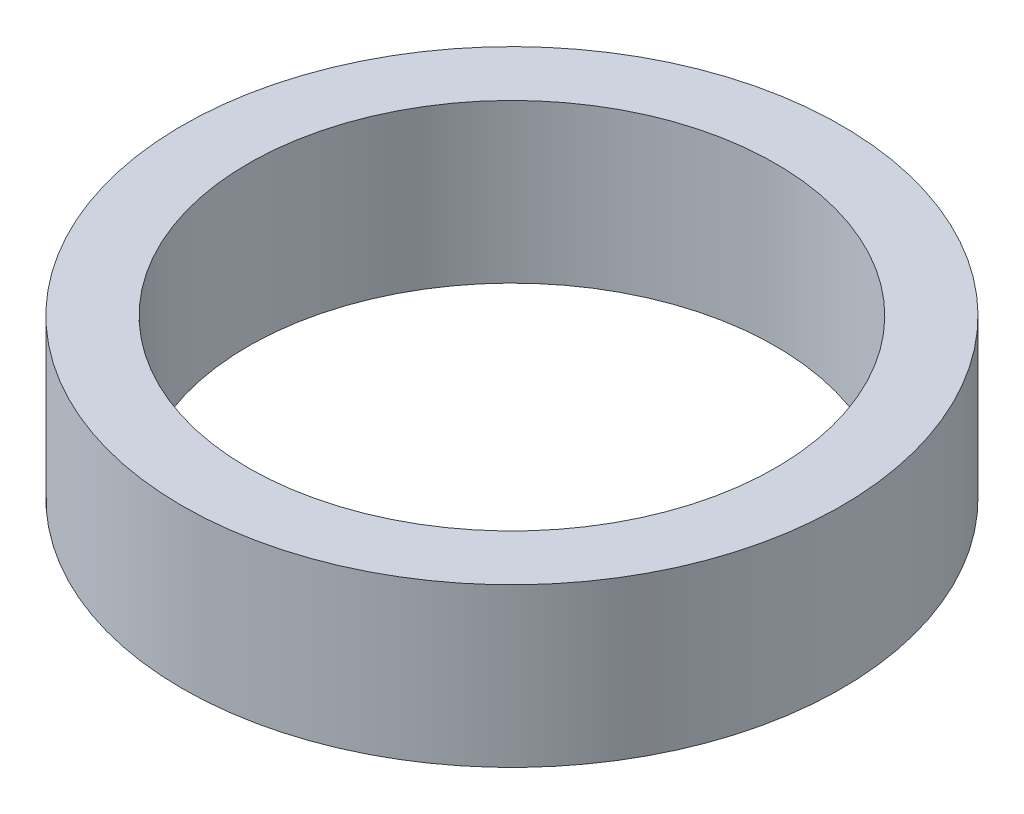
ISO-10303-21;
HEADER;
FILE_DESCRIPTION(('STEP AP214'),'2;1');
FILE_NAME('part.step','',(''),(''),'','','');
FILE_SCHEMA(('AUTOMOTIVE_DESIGN { 1 0 10303 214 1 1 1 1 }'));
ENDSEC;
DATA;
#1=APPLICATION_CONTEXT('core data for automotive mechanical design processes');
#2=APPLICATION_PROTOCOL_DEFINITION('international standard','automotive_design',2000,#1);
#3=PRODUCT_CONTEXT('',#1,'mechanical');
#4=PRODUCT('Part','Part','',(#3));
#5=PRODUCT_RELATED_PRODUCT_CATEGORY('part','',(#4));
#6=PRODUCT_DEFINITION_FORMATION('','',#4);
#7=PRODUCT_DEFINITION_CONTEXT('part definition',#1,'design');
#8=PRODUCT_DEFINITION('design','',#6,#7);
#9=PRODUCT_DEFINITION_SHAPE('','',#8);
#10=(LENGTH_UNIT() NAMED_UNIT(*) SI_UNIT(.MILLI.,.METRE.));
#11=(NAMED_UNIT(*) PLANE_ANGLE_UNIT() SI_UNIT($,.RADIAN.));
#12=(NAMED_UNIT(*) SI_UNIT($,.STERADIAN.) SOLID_ANGLE_UNIT());
#13=UNCERTAINTY_MEASURE_WITH_UNIT(LENGTH_MEASURE(1.E-05),#10,'distance_accuracy_value','');
#14=(GEOMETRIC_REPRESENTATION_CONTEXT(3) GLOBAL_UNCERTAINTY_ASSIGNED_CONTEXT((#13)) GLOBAL_UNIT_ASSIGNED_CONTEXT((#10,
#11,#12)) REPRESENTATION_CONTEXT('',''));
#15=CARTESIAN_POINT('',(0.,0.,0.));
#16=DIRECTION('',(0.,0.,1.));
#17=DIRECTION('',(1.,0.,0.));
#18=AXIS2_PLACEMENT_3D('',#15,#16,#17);
#19=CARTESIAN_POINT('',(0.,30.,0.));
#20=DIRECTION('',(0.,-1.,0.));
#21=DIRECTION('',(0.,0.,-1.));
#22=AXIS2_PLACEMENT_3D('',#19,#20,#21);
#23=CYLINDRICAL_SURFACE('',#22,62.5);
#24=CARTESIAN_POINT('',(0.,30.,0.));
#25=DIRECTION('',(0.,1.,0.));
#26=DIRECTION('',(0.,0.,1.));
#27=AXIS2_PLACEMENT_3D('',#24,#25,#26);
#28=CIRCLE('',#27,62.5);
#29=CARTESIAN_POINT('',(0.,30.,62.5));
#30=VERTEX_POINT('',#29);
#31=EDGE_CURVE('E10',#30,#30,#28,.T.);
#32=ORIENTED_EDGE('',*,*,#31,.F.);
#33=EDGE_LOOP('',(#32));
#34=FACE_BOUND('',#33,.T.);
#35=CARTESIAN_POINT('',(0.,0.,0.));
#36=DIRECTION('',(0.,1.,0.));
#37=DIRECTION('',(0.,0.,1.));
#38=AXIS2_PLACEMENT_3D('',#35,#36,#37);
#39=CIRCLE('',#38,62.5);
#40=CARTESIAN_POINT('',(0.,0.,62.5));
#41=VERTEX_POINT('',#40);
#42=EDGE_CURVE('E37',#41,#41,#39,.T.);
#43=ORIENTED_EDGE('',*,*,#42,.T.);
#44=EDGE_LOOP('',(#43));
#45=FACE_BOUND('',#44,.T.);
#46=ADVANCED_FACE('F40',(#34,#45),#23,.T.);
#47=CARTESIAN_POINT('',(0.,30.,0.));
#48=DIRECTION('',(0.,1.,0.));
#49=DIRECTION('',(0.,0.,1.));
#50=AXIS2_PLACEMENT_3D('',#47,#48,#49);
#51=PLANE('',#50);
#52=CARTESIAN_POINT('',(0.,30.,0.));
#53=DIRECTION('',(0.,1.,0.));
#54=DIRECTION('',(0.,0.,1.));
#55=AXIS2_PLACEMENT_3D('',#52,#53,#54);
#56=CIRCLE('',#55,50.);
#57=CARTESIAN_POINT('',(0.,30.,50.));
#58=VERTEX_POINT('',#57);
#59=EDGE_CURVE('E50',#58,#58,#56,.T.);
#60=ORIENTED_EDGE('',*,*,#59,.F.);
#61=EDGE_LOOP('',(#60));
#62=FACE_BOUND('',#61,.T.);
#63=ORIENTED_EDGE('',*,*,#31,.T.);
#64=EDGE_LOOP('',(#63));
#65=FACE_BOUND('',#64,.T.);
#66=ADVANCED_FACE('F59',(#62,#65),#51,.T.);
#67=CARTESIAN_POINT('',(0.,0.,0.));
#68=DIRECTION('',(0.,1.,0.));
#69=DIRECTION('',(0.,0.,1.));
#70=AXIS2_PLACEMENT_3D('',#67,#68,#69);
#71=PLANE('',#70);
#72=CARTESIAN_POINT('',(0.,0.,0.));
#73=DIRECTION('',(0.,1.,0.));
#74=DIRECTION('',(0.,0.,1.));
#75=AXIS2_PLACEMENT_3D('',#72,#73,#74);
#76=CIRCLE('',#75,50.);
#77=CARTESIAN_POINT('',(0.,0.,50.));
#78=VERTEX_POINT('',#77);
#79=EDGE_CURVE('E47',#78,#78,#76,.T.);
#80=ORIENTED_EDGE('',*,*,#79,.T.);
#81=EDGE_LOOP('',(#80));
#82=FACE_BOUND('',#81,.T.);
#83=ORIENTED_EDGE('',*,*,#42,.F.);
#84=EDGE_LOOP('',(#83));
#85=FACE_BOUND('',#84,.T.);
#86=ADVANCED_FACE('F58',(#82,#85),#71,.F.);
#87=CARTESIAN_POINT('',(0.,30.,0.));
#88=DIRECTION('',(0.,-1.,0.));
#89=DIRECTION('',(0.,0.,-1.));
#90=AXIS2_PLACEMENT_3D('',#87,#88,#89);
#91=CYLINDRICAL_SURFACE('',#90,50.);
#92=ORIENTED_EDGE('',*,*,#59,.T.);
#93=EDGE_LOOP('',(#92));
#94=FACE_BOUND('',#93,.T.);
#95=ORIENTED_EDGE('',*,*,#79,.F.);
#96=EDGE_LOOP('',(#95));
#97=FACE_BOUND('',#96,.T.);
#98=ADVANCED_FACE('F54',(#94,#97),#91,.F.);
#99=CLOSED_SHELL('',(#46,#66,#86,#98));
#100=MANIFOLD_SOLID_BREP('B2',#99);
#101=ADVANCED_BREP_SHAPE_REPRESENTATION('',(#18,#100),#14);
#102=SHAPE_DEFINITION_REPRESENTATION(#9,#101);
ENDSEC;
END-ISO-10303-21;
